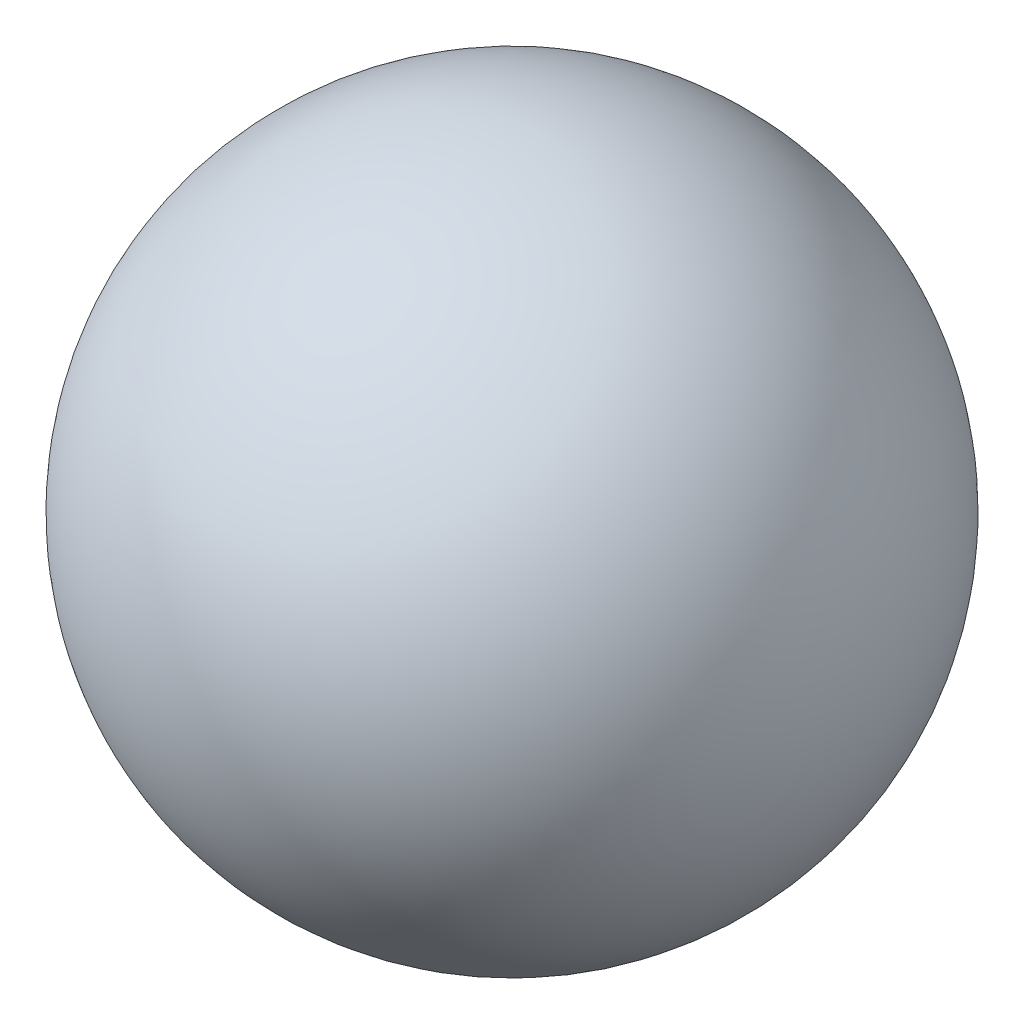
ISO-10303-21;
HEADER;
FILE_DESCRIPTION(('STEP AP214'),'2;1');
FILE_NAME('part.step','',(''),(''),'','','');
FILE_SCHEMA(('AUTOMOTIVE_DESIGN { 1 0 10303 214 1 1 1 1 }'));
ENDSEC;
DATA;
#1=APPLICATION_CONTEXT('core data for automotive mechanical design processes');
#2=APPLICATION_PROTOCOL_DEFINITION('international standard','automotive_design',2000,#1);
#3=PRODUCT_CONTEXT('',#1,'mechanical');
#4=PRODUCT('Part','Part','',(#3));
#5=PRODUCT_RELATED_PRODUCT_CATEGORY('part','',(#4));
#6=PRODUCT_DEFINITION_FORMATION('','',#4);
#7=PRODUCT_DEFINITION_CONTEXT('part definition',#1,'design');
#8=PRODUCT_DEFINITION('design','',#6,#7);
#9=PRODUCT_DEFINITION_SHAPE('','',#8);
#10=(LENGTH_UNIT() NAMED_UNIT(*) SI_UNIT(.MILLI.,.METRE.));
#11=(NAMED_UNIT(*) PLANE_ANGLE_UNIT() SI_UNIT($,.RADIAN.));
#12=(NAMED_UNIT(*) SI_UNIT($,.STERADIAN.) SOLID_ANGLE_UNIT());
#13=UNCERTAINTY_MEASURE_WITH_UNIT(LENGTH_MEASURE(1.E-05),#10,'distance_accuracy_value','');
#14=(GEOMETRIC_REPRESENTATION_CONTEXT(3) GLOBAL_UNCERTAINTY_ASSIGNED_CONTEXT((#13)) GLOBAL_UNIT_ASSIGNED_CONTEXT((#10,
#11,#12)) REPRESENTATION_CONTEXT('',''));
#15=CARTESIAN_POINT('',(0.,0.,0.));
#16=DIRECTION('',(0.,0.,1.));
#17=DIRECTION('',(1.,0.,0.));
#18=AXIS2_PLACEMENT_3D('',#15,#16,#17);
#19=CARTESIAN_POINT('',(11.1037596198974,-2.,-3.84304856897969));
#20=DIRECTION('',(0.,0.,1.));
#21=DIRECTION('',(1.,0.,0.));
#22=AXIS2_PLACEMENT_3D('',#19,#20,#21);
#23=SPHERICAL_SURFACE('',#22,1.05);
#24=CARTESIAN_POINT('',(11.1037596198974,-2.,-2.79304856897969));
#25=VERTEX_POINT('',#24);
#26=VERTEX_LOOP('',#25);
#27=FACE_BOUND('',#26,.T.);
#28=ADVANCED_FACE('F12',(#27),#23,.T.);
#29=CLOSED_SHELL('',(#28));
#30=MANIFOLD_SOLID_BREP('B1',#29);
#31=ADVANCED_BREP_SHAPE_REPRESENTATION('',(#18,#30),#14);
#32=SHAPE_DEFINITION_REPRESENTATION(#9,#31);
ENDSEC;
END-ISO-10303-21;
